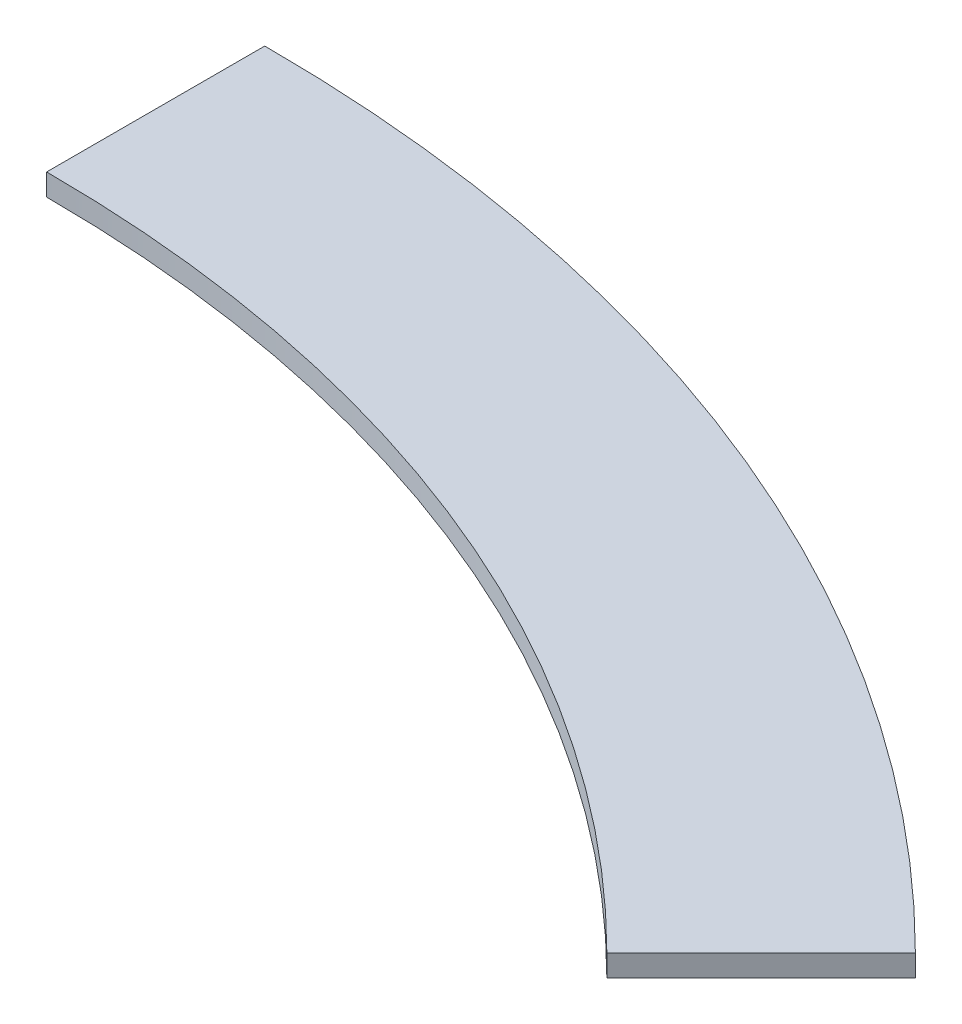
ISO-10303-21;
HEADER;
FILE_DESCRIPTION(('STEP AP214'),'2;1');
FILE_NAME('part.step','',(''),(''),'','','');
FILE_SCHEMA(('AUTOMOTIVE_DESIGN { 1 0 10303 214 1 1 1 1 }'));
ENDSEC;
DATA;
#1=APPLICATION_CONTEXT('core data for automotive mechanical design processes');
#2=APPLICATION_PROTOCOL_DEFINITION('international standard','automotive_design',2000,#1);
#3=PRODUCT_CONTEXT('',#1,'mechanical');
#4=PRODUCT('Part','Part','',(#3));
#5=PRODUCT_RELATED_PRODUCT_CATEGORY('part','',(#4));
#6=PRODUCT_DEFINITION_FORMATION('','',#4);
#7=PRODUCT_DEFINITION_CONTEXT('part definition',#1,'design');
#8=PRODUCT_DEFINITION('design','',#6,#7);
#9=PRODUCT_DEFINITION_SHAPE('','',#8);
#10=(LENGTH_UNIT() NAMED_UNIT(*) SI_UNIT(.MILLI.,.METRE.));
#11=(NAMED_UNIT(*) PLANE_ANGLE_UNIT() SI_UNIT($,.RADIAN.));
#12=(NAMED_UNIT(*) SI_UNIT($,.STERADIAN.) SOLID_ANGLE_UNIT());
#13=UNCERTAINTY_MEASURE_WITH_UNIT(LENGTH_MEASURE(1.E-05),#10,'distance_accuracy_value','');
#14=(GEOMETRIC_REPRESENTATION_CONTEXT(3) GLOBAL_UNCERTAINTY_ASSIGNED_CONTEXT((#13)) GLOBAL_UNIT_ASSIGNED_CONTEXT((#10,
#11,#12)) REPRESENTATION_CONTEXT('',''));
#15=CARTESIAN_POINT('',(0.,0.,0.));
#16=DIRECTION('',(0.,0.,1.));
#17=DIRECTION('',(1.,0.,0.));
#18=AXIS2_PLACEMENT_3D('',#15,#16,#17);
#19=CARTESIAN_POINT('',(0.,10.,0.));
#20=DIRECTION('',(0.,-1.,0.));
#21=DIRECTION('',(0.,0.,-1.));
#22=AXIS2_PLACEMENT_3D('',#19,#20,#21);
#23=CYLINDRICAL_SURFACE('',#22,720.);
#24=CARTESIAN_POINT('',(0.,0.,0.));
#25=DIRECTION('',(0.,1.,0.));
#26=DIRECTION('',(0.,0.,1.));
#27=AXIS2_PLACEMENT_3D('',#24,#25,#26);
#28=CIRCLE('',#27,720.);
#29=CARTESIAN_POINT('',(0.,0.,-720.));
#30=VERTEX_POINT('',#29);
#31=CARTESIAN_POINT('',(509.116882454315,0.,-509.116882454313));
#32=VERTEX_POINT('',#31);
#33=EDGE_CURVE('E97',#30,#32,#28,.F.);
#34=ORIENTED_EDGE('',*,*,#33,.F.);
#35=DIRECTION('',(0.,-1.,0.));
#36=VECTOR('',#35,1.);
#37=CARTESIAN_POINT('',(0.,10.,-720.));
#38=LINE('',#37,#36);
#39=CARTESIAN_POINT('',(0.,10.,-720.));
#40=VERTEX_POINT('',#39);
#41=EDGE_CURVE('E11',#40,#30,#38,.T.);
#42=ORIENTED_EDGE('',*,*,#41,.F.);
#43=CARTESIAN_POINT('',(0.,10.,0.));
#44=DIRECTION('',(0.,1.,0.));
#45=DIRECTION('',(0.,0.,1.));
#46=AXIS2_PLACEMENT_3D('',#43,#44,#45);
#47=CIRCLE('',#46,720.);
#48=CARTESIAN_POINT('',(509.116882454315,10.,-509.116882454313));
#49=VERTEX_POINT('',#48);
#50=EDGE_CURVE('E91',#40,#49,#47,.F.);
#51=ORIENTED_EDGE('',*,*,#50,.T.);
#52=DIRECTION('',(0.,-1.,0.));
#53=VECTOR('',#52,1.);
#54=CARTESIAN_POINT('',(509.116882454315,10.,-509.116882454313));
#55=LINE('',#54,#53);
#56=EDGE_CURVE('E72',#49,#32,#55,.T.);
#57=ORIENTED_EDGE('',*,*,#56,.T.);
#58=EDGE_LOOP('',(#34,#42,#51,#57));
#59=FACE_BOUND('',#58,.T.);
#60=ADVANCED_FACE('F34',(#59),#23,.T.);
#61=CARTESIAN_POINT('',(0.,10.,0.));
#62=DIRECTION('',(-1.,0.,0.));
#63=DIRECTION('',(0.,0.,1.));
#64=AXIS2_PLACEMENT_3D('',#61,#62,#63);
#65=PLANE('',#64);
#66=DIRECTION('',(0.,0.,-1.));
#67=VECTOR('',#66,1.);
#68=CARTESIAN_POINT('',(0.,0.,0.));
#69=LINE('',#68,#67);
#70=CARTESIAN_POINT('',(0.,0.,-620.));
#71=VERTEX_POINT('',#70);
#72=EDGE_CURVE('E85',#71,#30,#69,.T.);
#73=ORIENTED_EDGE('',*,*,#72,.F.);
#74=DIRECTION('',(0.,-1.,0.));
#75=VECTOR('',#74,1.);
#76=CARTESIAN_POINT('',(0.,10.,-620.));
#77=LINE('',#76,#75);
#78=CARTESIAN_POINT('',(0.,10.,-620.));
#79=VERTEX_POINT('',#78);
#80=EDGE_CURVE('E42',#79,#71,#77,.T.);
#81=ORIENTED_EDGE('',*,*,#80,.F.);
#82=DIRECTION('',(0.,0.,-1.));
#83=VECTOR('',#82,1.);
#84=CARTESIAN_POINT('',(0.,10.,0.));
#85=LINE('',#84,#83);
#86=EDGE_CURVE('E83',#79,#40,#85,.T.);
#87=ORIENTED_EDGE('',*,*,#86,.T.);
#88=ORIENTED_EDGE('',*,*,#41,.T.);
#89=EDGE_LOOP('',(#73,#81,#87,#88));
#90=FACE_BOUND('',#89,.T.);
#91=ADVANCED_FACE('F81',(#90),#65,.T.);
#92=CARTESIAN_POINT('',(0.,10.,0.));
#93=DIRECTION('',(0.,-1.,0.));
#94=DIRECTION('',(0.,0.,-1.));
#95=AXIS2_PLACEMENT_3D('',#92,#93,#94);
#96=CYLINDRICAL_SURFACE('',#95,620.);
#97=CARTESIAN_POINT('',(0.,0.,0.));
#98=DIRECTION('',(0.,1.,0.));
#99=DIRECTION('',(0.,0.,1.));
#100=AXIS2_PLACEMENT_3D('',#97,#98,#99);
#101=CIRCLE('',#100,620.);
#102=CARTESIAN_POINT('',(438.40620433566,0.,-438.406204335659));
#103=VERTEX_POINT('',#102);
#104=EDGE_CURVE('E65',#71,#103,#101,.F.);
#105=ORIENTED_EDGE('',*,*,#104,.T.);
#106=DIRECTION('',(0.,-1.,0.));
#107=VECTOR('',#106,1.);
#108=CARTESIAN_POINT('',(438.40620433566,10.,-438.406204335659));
#109=LINE('',#108,#107);
#110=CARTESIAN_POINT('',(438.40620433566,10.,-438.406204335659));
#111=VERTEX_POINT('',#110);
#112=EDGE_CURVE('E86',#111,#103,#109,.T.);
#113=ORIENTED_EDGE('',*,*,#112,.F.);
#114=CARTESIAN_POINT('',(0.,10.,0.));
#115=DIRECTION('',(0.,1.,0.));
#116=DIRECTION('',(0.,0.,1.));
#117=AXIS2_PLACEMENT_3D('',#114,#115,#116);
#118=CIRCLE('',#117,620.);
#119=EDGE_CURVE('E87',#79,#111,#118,.F.);
#120=ORIENTED_EDGE('',*,*,#119,.F.);
#121=ORIENTED_EDGE('',*,*,#80,.T.);
#122=EDGE_LOOP('',(#105,#113,#120,#121));
#123=FACE_BOUND('',#122,.T.);
#124=ADVANCED_FACE('F88',(#123),#96,.F.);
#125=CARTESIAN_POINT('',(-1.57009245868377E-13,10.,-1.57009245868378E-13));
#126=DIRECTION('',(-0.707106781186546,0.,-0.707106781186549));
#127=DIRECTION('',(-0.707106781186549,0.,0.707106781186546));
#128=AXIS2_PLACEMENT_3D('',#125,#126,#127);
#129=PLANE('',#128);
#130=DIRECTION('',(0.707106781186549,0.,-0.707106781186546));
#131=VECTOR('',#130,1.);
#132=CARTESIAN_POINT('',(-1.57009245868377E-13,0.,-1.57009245868378E-13));
#133=LINE('',#132,#131);
#134=EDGE_CURVE('E93',#103,#32,#133,.T.);
#135=ORIENTED_EDGE('',*,*,#134,.T.);
#136=ORIENTED_EDGE('',*,*,#56,.F.);
#137=DIRECTION('',(0.707106781186549,0.,-0.707106781186546));
#138=VECTOR('',#137,1.);
#139=CARTESIAN_POINT('',(-1.57009245868377E-13,10.,-1.57009245868378E-13));
#140=LINE('',#139,#138);
#141=EDGE_CURVE('E50',#111,#49,#140,.T.);
#142=ORIENTED_EDGE('',*,*,#141,.F.);
#143=ORIENTED_EDGE('',*,*,#112,.T.);
#144=EDGE_LOOP('',(#135,#136,#142,#143));
#145=FACE_BOUND('',#144,.T.);
#146=ADVANCED_FACE('F106',(#145),#129,.F.);
#147=CARTESIAN_POINT('',(0.,10.,0.));
#148=DIRECTION('',(0.,1.,0.));
#149=DIRECTION('',(0.,0.,1.));
#150=AXIS2_PLACEMENT_3D('',#147,#148,#149);
#151=PLANE('',#150);
#152=ORIENTED_EDGE('',*,*,#50,.F.);
#153=ORIENTED_EDGE('',*,*,#86,.F.);
#154=ORIENTED_EDGE('',*,*,#119,.T.);
#155=ORIENTED_EDGE('',*,*,#141,.T.);
#156=EDGE_LOOP('',(#152,#153,#154,#155));
#157=FACE_BOUND('',#156,.T.);
#158=ADVANCED_FACE('F90',(#157),#151,.T.);
#159=CARTESIAN_POINT('',(0.,0.,0.));
#160=DIRECTION('',(0.,1.,0.));
#161=DIRECTION('',(0.,0.,1.));
#162=AXIS2_PLACEMENT_3D('',#159,#160,#161);
#163=PLANE('',#162);
#164=ORIENTED_EDGE('',*,*,#33,.T.);
#165=ORIENTED_EDGE('',*,*,#134,.F.);
#166=ORIENTED_EDGE('',*,*,#104,.F.);
#167=ORIENTED_EDGE('',*,*,#72,.T.);
#168=EDGE_LOOP('',(#164,#165,#166,#167));
#169=FACE_BOUND('',#168,.T.);
#170=ADVANCED_FACE('F108',(#169),#163,.F.);
#171=CLOSED_SHELL('',(#60,#91,#124,#146,#158,#170));
#172=MANIFOLD_SOLID_BREP('B2',#171);
#173=ADVANCED_BREP_SHAPE_REPRESENTATION('',(#18,#172),#14);
#174=SHAPE_DEFINITION_REPRESENTATION(#9,#173);
ENDSEC;
END-ISO-10303-21;
